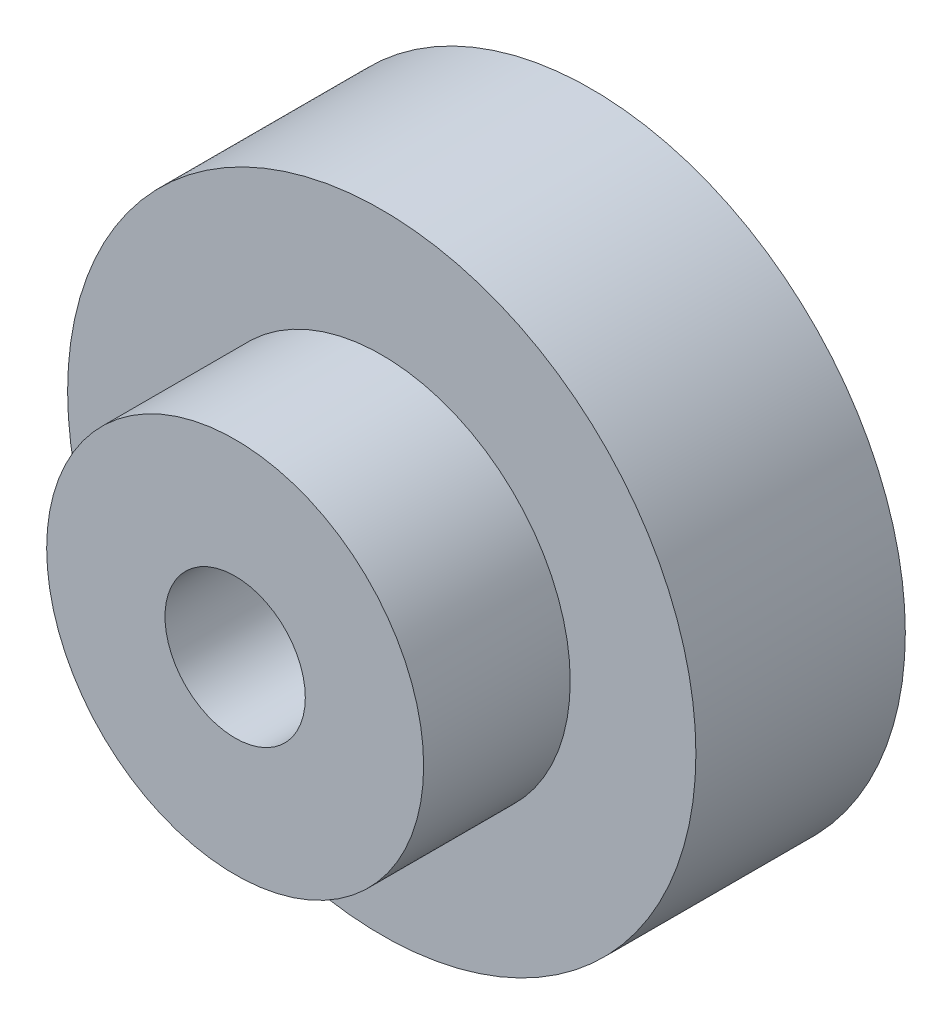
ISO-10303-21;
HEADER;
FILE_DESCRIPTION(('STEP AP214'),'2;1');
FILE_NAME('part.step','',(''),(''),'','','');
FILE_SCHEMA(('AUTOMOTIVE_DESIGN { 1 0 10303 214 1 1 1 1 }'));
ENDSEC;
DATA;
#1=APPLICATION_CONTEXT('core data for automotive mechanical design processes');
#2=APPLICATION_PROTOCOL_DEFINITION('international standard','automotive_design',2000,#1);
#3=PRODUCT_CONTEXT('',#1,'mechanical');
#4=PRODUCT('Part','Part','',(#3));
#5=PRODUCT_RELATED_PRODUCT_CATEGORY('part','',(#4));
#6=PRODUCT_DEFINITION_FORMATION('','',#4);
#7=PRODUCT_DEFINITION_CONTEXT('part definition',#1,'design');
#8=PRODUCT_DEFINITION('design','',#6,#7);
#9=PRODUCT_DEFINITION_SHAPE('','',#8);
#10=(LENGTH_UNIT() NAMED_UNIT(*) SI_UNIT(.MILLI.,.METRE.));
#11=(NAMED_UNIT(*) PLANE_ANGLE_UNIT() SI_UNIT($,.RADIAN.));
#12=(NAMED_UNIT(*) SI_UNIT($,.STERADIAN.) SOLID_ANGLE_UNIT());
#13=UNCERTAINTY_MEASURE_WITH_UNIT(LENGTH_MEASURE(1.E-05),#10,'distance_accuracy_value','');
#14=(GEOMETRIC_REPRESENTATION_CONTEXT(3) GLOBAL_UNCERTAINTY_ASSIGNED_CONTEXT((#13)) GLOBAL_UNIT_ASSIGNED_CONTEXT((#10,
#11,#12)) REPRESENTATION_CONTEXT('',''));
#15=CARTESIAN_POINT('',(0.,0.,0.));
#16=DIRECTION('',(0.,0.,1.));
#17=DIRECTION('',(1.,0.,0.));
#18=AXIS2_PLACEMENT_3D('',#15,#16,#17);
#19=CARTESIAN_POINT('',(0.,0.,10.));
#20=DIRECTION('',(0.,0.,1.));
#21=DIRECTION('',(1.,0.,0.));
#22=AXIS2_PLACEMENT_3D('',#19,#20,#21);
#23=PLANE('',#22);
#24=CARTESIAN_POINT('',(0.,0.,10.));
#25=DIRECTION('',(0.,0.,1.));
#26=DIRECTION('',(1.,0.,0.));
#27=AXIS2_PLACEMENT_3D('',#24,#25,#26);
#28=CIRCLE('',#27,15.);
#29=CARTESIAN_POINT('',(15.,0.,10.));
#30=VERTEX_POINT('',#29);
#31=EDGE_CURVE('E10',#30,#30,#28,.T.);
#32=ORIENTED_EDGE('',*,*,#31,.T.);
#33=EDGE_LOOP('',(#32));
#34=FACE_BOUND('',#33,.T.);
#35=CARTESIAN_POINT('',(0.,0.,10.));
#36=DIRECTION('',(0.,0.,1.));
#37=DIRECTION('',(1.,0.,0.));
#38=AXIS2_PLACEMENT_3D('',#35,#36,#37);
#39=CIRCLE('',#38,9.);
#40=CARTESIAN_POINT('',(9.,0.,10.));
#41=VERTEX_POINT('',#40);
#42=EDGE_CURVE('E48',#41,#41,#39,.T.);
#43=ORIENTED_EDGE('',*,*,#42,.F.);
#44=EDGE_LOOP('',(#43));
#45=FACE_BOUND('',#44,.T.);
#46=ADVANCED_FACE('F32',(#34,#45),#23,.T.);
#47=CARTESIAN_POINT('',(0.,0.,0.));
#48=DIRECTION('',(0.,0.,1.));
#49=DIRECTION('',(1.,0.,0.));
#50=AXIS2_PLACEMENT_3D('',#47,#48,#49);
#51=PLANE('',#50);
#52=CARTESIAN_POINT('',(0.,0.,0.));
#53=DIRECTION('',(0.,0.,1.));
#54=DIRECTION('',(1.,0.,0.));
#55=AXIS2_PLACEMENT_3D('',#52,#53,#54);
#56=CIRCLE('',#55,15.);
#57=CARTESIAN_POINT('',(15.,0.,0.));
#58=VERTEX_POINT('',#57);
#59=EDGE_CURVE('E36',#58,#58,#56,.T.);
#60=ORIENTED_EDGE('',*,*,#59,.F.);
#61=EDGE_LOOP('',(#60));
#62=FACE_BOUND('',#61,.T.);
#63=CARTESIAN_POINT('',(0.,0.,0.));
#64=DIRECTION('',(0.,0.,1.));
#65=DIRECTION('',(1.,0.,0.));
#66=AXIS2_PLACEMENT_3D('',#63,#64,#65);
#67=CIRCLE('',#66,3.35);
#68=CARTESIAN_POINT('',(3.35,0.,0.));
#69=VERTEX_POINT('',#68);
#70=EDGE_CURVE('E43',#69,#69,#67,.T.);
#71=ORIENTED_EDGE('',*,*,#70,.T.);
#72=EDGE_LOOP('',(#71));
#73=FACE_BOUND('',#72,.T.);
#74=ADVANCED_FACE('F73',(#62,#73),#51,.F.);
#75=CARTESIAN_POINT('',(0.,0.,10.));
#76=DIRECTION('',(0.,0.,-1.));
#77=DIRECTION('',(-1.,0.,0.));
#78=AXIS2_PLACEMENT_3D('',#75,#76,#77);
#79=CYLINDRICAL_SURFACE('',#78,15.);
#80=ORIENTED_EDGE('',*,*,#31,.F.);
#81=EDGE_LOOP('',(#80));
#82=FACE_BOUND('',#81,.T.);
#83=ORIENTED_EDGE('',*,*,#59,.T.);
#84=EDGE_LOOP('',(#83));
#85=FACE_BOUND('',#84,.T.);
#86=ADVANCED_FACE('F34',(#82,#85),#79,.T.);
#87=CARTESIAN_POINT('',(0.,0.,10.));
#88=DIRECTION('',(0.,0.,-1.));
#89=DIRECTION('',(-1.,0.,0.));
#90=AXIS2_PLACEMENT_3D('',#87,#88,#89);
#91=CYLINDRICAL_SURFACE('',#90,3.35);
#92=ORIENTED_EDGE('',*,*,#70,.F.);
#93=EDGE_LOOP('',(#92));
#94=FACE_BOUND('',#93,.T.);
#95=CARTESIAN_POINT('',(0.,0.,17.));
#96=DIRECTION('',(0.,0.,1.));
#97=DIRECTION('',(1.,0.,0.));
#98=AXIS2_PLACEMENT_3D('',#95,#96,#97);
#99=CIRCLE('',#98,3.35);
#100=CARTESIAN_POINT('',(3.35,0.,17.));
#101=VERTEX_POINT('',#100);
#102=EDGE_CURVE('E51',#101,#101,#99,.T.);
#103=ORIENTED_EDGE('',*,*,#102,.T.);
#104=EDGE_LOOP('',(#103));
#105=FACE_BOUND('',#104,.T.);
#106=ADVANCED_FACE('F57',(#94,#105),#91,.F.);
#107=CARTESIAN_POINT('',(0.,0.,17.));
#108=DIRECTION('',(0.,0.,1.));
#109=DIRECTION('',(1.,0.,0.));
#110=AXIS2_PLACEMENT_3D('',#107,#108,#109);
#111=PLANE('',#110);
#112=CARTESIAN_POINT('',(0.,0.,17.));
#113=DIRECTION('',(0.,0.,1.));
#114=DIRECTION('',(1.,0.,0.));
#115=AXIS2_PLACEMENT_3D('',#112,#113,#114);
#116=CIRCLE('',#115,9.);
#117=CARTESIAN_POINT('',(9.,0.,17.));
#118=VERTEX_POINT('',#117);
#119=EDGE_CURVE('E47',#118,#118,#116,.T.);
#120=ORIENTED_EDGE('',*,*,#119,.T.);
#121=EDGE_LOOP('',(#120));
#122=FACE_BOUND('',#121,.T.);
#123=ORIENTED_EDGE('',*,*,#102,.F.);
#124=EDGE_LOOP('',(#123));
#125=FACE_BOUND('',#124,.T.);
#126=ADVANCED_FACE('F59',(#122,#125),#111,.T.);
#127=CARTESIAN_POINT('',(0.,0.,17.));
#128=DIRECTION('',(0.,0.,-1.));
#129=DIRECTION('',(-1.,0.,0.));
#130=AXIS2_PLACEMENT_3D('',#127,#128,#129);
#131=CYLINDRICAL_SURFACE('',#130,9.);
#132=ORIENTED_EDGE('',*,*,#119,.F.);
#133=EDGE_LOOP('',(#132));
#134=FACE_BOUND('',#133,.T.);
#135=ORIENTED_EDGE('',*,*,#42,.T.);
#136=EDGE_LOOP('',(#135));
#137=FACE_BOUND('',#136,.T.);
#138=ADVANCED_FACE('F61',(#134,#137),#131,.T.);
#139=CLOSED_SHELL('',(#46,#74,#86,#106,#126,#138));
#140=MANIFOLD_SOLID_BREP('B2',#139);
#141=ADVANCED_BREP_SHAPE_REPRESENTATION('',(#18,#140),#14);
#142=SHAPE_DEFINITION_REPRESENTATION(#9,#141);
ENDSEC;
END-ISO-10303-21;
